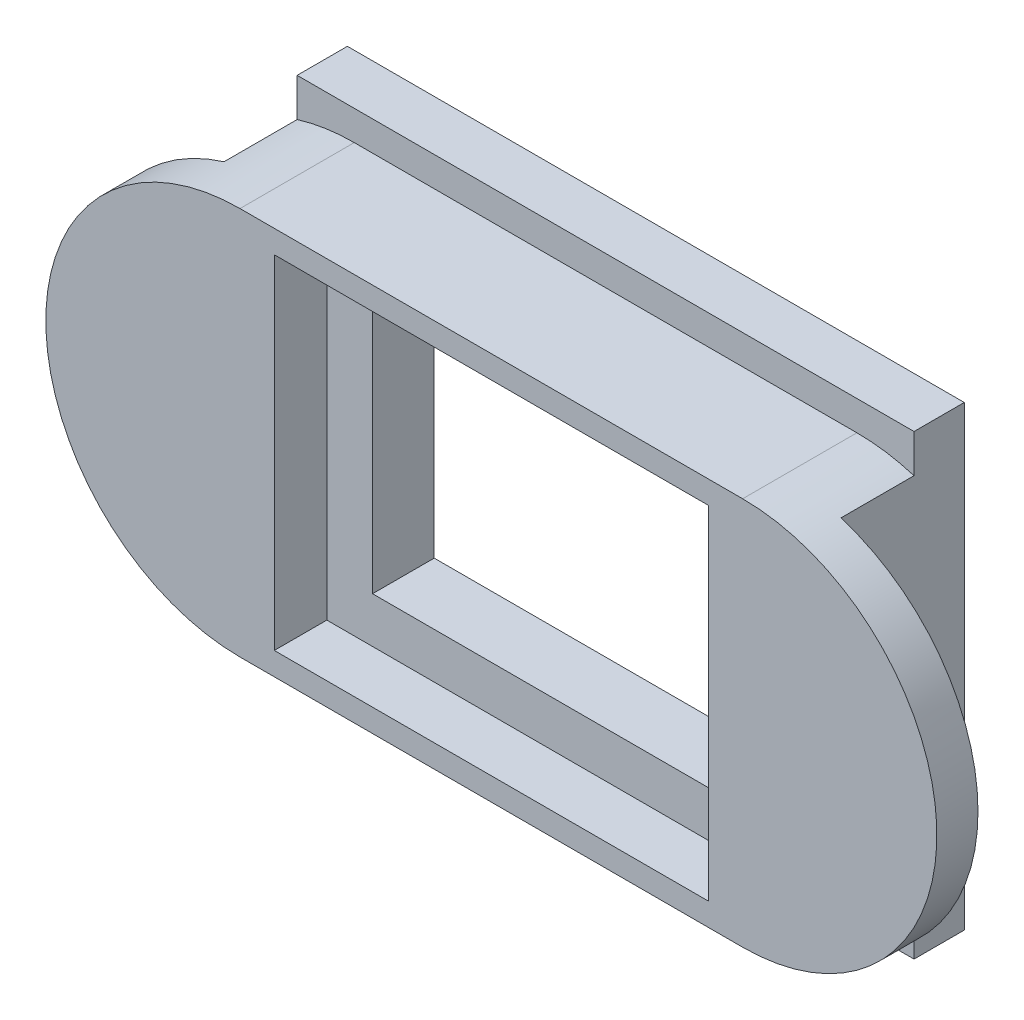
ISO-10303-21;
HEADER;
FILE_DESCRIPTION(('STEP AP214'),'2;1');
FILE_NAME('part.step','',(''),(''),'','','');
FILE_SCHEMA(('AUTOMOTIVE_DESIGN { 1 0 10303 214 1 1 1 1 }'));
ENDSEC;
DATA;
#1=APPLICATION_CONTEXT('core data for automotive mechanical design processes');
#2=APPLICATION_PROTOCOL_DEFINITION('international standard','automotive_design',2000,#1);
#3=PRODUCT_CONTEXT('',#1,'mechanical');
#4=PRODUCT('Part','Part','',(#3));
#5=PRODUCT_RELATED_PRODUCT_CATEGORY('part','',(#4));
#6=PRODUCT_DEFINITION_FORMATION('','',#4);
#7=PRODUCT_DEFINITION_CONTEXT('part definition',#1,'design');
#8=PRODUCT_DEFINITION('design','',#6,#7);
#9=PRODUCT_DEFINITION_SHAPE('','',#8);
#10=(LENGTH_UNIT() NAMED_UNIT(*) SI_UNIT(.MILLI.,.METRE.));
#11=(NAMED_UNIT(*) PLANE_ANGLE_UNIT() SI_UNIT($,.RADIAN.));
#12=(NAMED_UNIT(*) SI_UNIT($,.STERADIAN.) SOLID_ANGLE_UNIT());
#13=UNCERTAINTY_MEASURE_WITH_UNIT(LENGTH_MEASURE(1.E-05),#10,'distance_accuracy_value','');
#14=(GEOMETRIC_REPRESENTATION_CONTEXT(3) GLOBAL_UNCERTAINTY_ASSIGNED_CONTEXT((#13)) GLOBAL_UNIT_ASSIGNED_CONTEXT((#10,
#11,#12)) REPRESENTATION_CONTEXT('',''));
#15=CARTESIAN_POINT('',(0.,0.,0.));
#16=DIRECTION('',(0.,0.,1.));
#17=DIRECTION('',(1.,0.,0.));
#18=AXIS2_PLACEMENT_3D('',#15,#16,#17);
#19=CARTESIAN_POINT('',(-11.,0.,5.));
#20=DIRECTION('',(0.,0.,-1.));
#21=DIRECTION('',(-1.,0.,0.));
#22=AXIS2_PLACEMENT_3D('',#19,#20,#21);
#23=CYLINDRICAL_SURFACE('',#22,8.5);
#24=DIRECTION('',(0.,0.,-1.));
#25=VECTOR('',#24,1.);
#26=CARTESIAN_POINT('',(-13.5,8.12403840463596,5.));
#27=LINE('',#26,#25);
#28=CARTESIAN_POINT('',(-13.5,8.12403840463596,3.2));
#29=VERTEX_POINT('',#28);
#30=CARTESIAN_POINT('',(-13.5,8.12403840463596,0.));
#31=VERTEX_POINT('',#30);
#32=EDGE_CURVE('E13',#29,#31,#27,.T.);
#33=ORIENTED_EDGE('',*,*,#32,.F.);
#34=CARTESIAN_POINT('',(-11.,0.,3.2));
#35=DIRECTION('',(0.,0.,1.));
#36=DIRECTION('',(1.,0.,0.));
#37=AXIS2_PLACEMENT_3D('',#34,#35,#36);
#38=CIRCLE('',#37,8.5);
#39=CARTESIAN_POINT('',(-13.5,-8.12403840463596,3.2));
#40=VERTEX_POINT('',#39);
#41=EDGE_CURVE('E289',#29,#40,#38,.T.);
#42=ORIENTED_EDGE('',*,*,#41,.T.);
#43=DIRECTION('',(0.,0.,-1.));
#44=VECTOR('',#43,1.);
#45=CARTESIAN_POINT('',(-13.5,-8.12403840463596,5.));
#46=LINE('',#45,#44);
#47=CARTESIAN_POINT('',(-13.5,-8.12403840463596,0.));
#48=VERTEX_POINT('',#47);
#49=EDGE_CURVE('E45',#48,#40,#46,.F.);
#50=ORIENTED_EDGE('',*,*,#49,.F.);
#51=CARTESIAN_POINT('',(-11.,0.,0.));
#52=DIRECTION('',(0.,0.,1.));
#53=DIRECTION('',(1.,0.,0.));
#54=AXIS2_PLACEMENT_3D('',#51,#52,#53);
#55=CIRCLE('',#54,8.5);
#56=CARTESIAN_POINT('',(-11.,-8.5,0.));
#57=VERTEX_POINT('',#56);
#58=EDGE_CURVE('E216',#48,#57,#55,.T.);
#59=ORIENTED_EDGE('',*,*,#58,.T.);
#60=DIRECTION('',(0.,0.,-1.));
#61=VECTOR('',#60,1.);
#62=CARTESIAN_POINT('',(-11.,-8.5,5.));
#63=LINE('',#62,#61);
#64=CARTESIAN_POINT('',(-11.,-8.5,5.));
#65=VERTEX_POINT('',#64);
#66=EDGE_CURVE('E268',#65,#57,#63,.T.);
#67=ORIENTED_EDGE('',*,*,#66,.F.);
#68=CARTESIAN_POINT('',(-11.,0.,5.));
#69=DIRECTION('',(0.,0.,1.));
#70=DIRECTION('',(1.,0.,0.));
#71=AXIS2_PLACEMENT_3D('',#68,#69,#70);
#72=CIRCLE('',#71,8.5);
#73=CARTESIAN_POINT('',(-11.,8.5,5.));
#74=VERTEX_POINT('',#73);
#75=EDGE_CURVE('E237',#74,#65,#72,.T.);
#76=ORIENTED_EDGE('',*,*,#75,.F.);
#77=DIRECTION('',(0.,0.,-1.));
#78=VECTOR('',#77,1.);
#79=CARTESIAN_POINT('',(-11.,8.5,5.));
#80=LINE('',#79,#78);
#81=CARTESIAN_POINT('',(-11.,8.5,0.));
#82=VERTEX_POINT('',#81);
#83=EDGE_CURVE('E247',#74,#82,#80,.T.);
#84=ORIENTED_EDGE('',*,*,#83,.T.);
#85=EDGE_CURVE('E248',#82,#31,#55,.T.);
#86=ORIENTED_EDGE('',*,*,#85,.T.);
#87=EDGE_LOOP('',(#33,#42,#50,#59,#67,#76,#84,#86));
#88=FACE_BOUND('',#87,.T.);
#89=ADVANCED_FACE('F38',(#88),#23,.T.);
#90=CARTESIAN_POINT('',(11.,0.,5.));
#91=DIRECTION('',(0.,0.,-1.));
#92=DIRECTION('',(-1.,0.,0.));
#93=AXIS2_PLACEMENT_3D('',#90,#91,#92);
#94=CYLINDRICAL_SURFACE('',#93,8.5);
#95=DIRECTION('',(0.,0.,-1.));
#96=VECTOR('',#95,1.);
#97=CARTESIAN_POINT('',(13.5,-8.12403840463596,5.));
#98=LINE('',#97,#96);
#99=CARTESIAN_POINT('',(13.5,-8.12403840463596,3.2));
#100=VERTEX_POINT('',#99);
#101=CARTESIAN_POINT('',(13.5,-8.12403840463596,0.));
#102=VERTEX_POINT('',#101);
#103=EDGE_CURVE('E276',#100,#102,#98,.T.);
#104=ORIENTED_EDGE('',*,*,#103,.F.);
#105=CARTESIAN_POINT('',(11.,0.,3.2));
#106=DIRECTION('',(0.,0.,1.));
#107=DIRECTION('',(1.,0.,0.));
#108=AXIS2_PLACEMENT_3D('',#105,#106,#107);
#109=CIRCLE('',#108,8.5);
#110=CARTESIAN_POINT('',(13.5,8.12403840463596,3.2));
#111=VERTEX_POINT('',#110);
#112=EDGE_CURVE('E291',#100,#111,#109,.T.);
#113=ORIENTED_EDGE('',*,*,#112,.T.);
#114=DIRECTION('',(0.,0.,-1.));
#115=VECTOR('',#114,1.);
#116=CARTESIAN_POINT('',(13.5,8.12403840463596,5.));
#117=LINE('',#116,#115);
#118=CARTESIAN_POINT('',(13.5,8.12403840463596,0.));
#119=VERTEX_POINT('',#118);
#120=EDGE_CURVE('E273',#119,#111,#117,.F.);
#121=ORIENTED_EDGE('',*,*,#120,.F.);
#122=CARTESIAN_POINT('',(11.,0.,0.));
#123=DIRECTION('',(0.,0.,1.));
#124=DIRECTION('',(1.,0.,0.));
#125=AXIS2_PLACEMENT_3D('',#122,#123,#124);
#126=CIRCLE('',#125,8.5);
#127=CARTESIAN_POINT('',(11.,8.5,0.));
#128=VERTEX_POINT('',#127);
#129=EDGE_CURVE('E254',#119,#128,#126,.T.);
#130=ORIENTED_EDGE('',*,*,#129,.T.);
#131=DIRECTION('',(0.,0.,-1.));
#132=VECTOR('',#131,1.);
#133=CARTESIAN_POINT('',(11.,8.5,5.));
#134=LINE('',#133,#132);
#135=CARTESIAN_POINT('',(11.,8.5,5.));
#136=VERTEX_POINT('',#135);
#137=EDGE_CURVE('E262',#136,#128,#134,.T.);
#138=ORIENTED_EDGE('',*,*,#137,.F.);
#139=CARTESIAN_POINT('',(11.,0.,5.));
#140=DIRECTION('',(0.,0.,1.));
#141=DIRECTION('',(1.,0.,0.));
#142=AXIS2_PLACEMENT_3D('',#139,#140,#141);
#143=CIRCLE('',#142,8.5);
#144=CARTESIAN_POINT('',(11.,-8.49999999999999,5.));
#145=VERTEX_POINT('',#144);
#146=EDGE_CURVE('E243',#145,#136,#143,.T.);
#147=ORIENTED_EDGE('',*,*,#146,.F.);
#148=DIRECTION('',(0.,0.,-1.));
#149=VECTOR('',#148,1.);
#150=CARTESIAN_POINT('',(11.,-8.49999999999999,5.));
#151=LINE('',#150,#149);
#152=CARTESIAN_POINT('',(11.,-8.49999999999999,0.));
#153=VERTEX_POINT('',#152);
#154=EDGE_CURVE('E265',#145,#153,#151,.T.);
#155=ORIENTED_EDGE('',*,*,#154,.T.);
#156=EDGE_CURVE('E255',#153,#102,#126,.T.);
#157=ORIENTED_EDGE('',*,*,#156,.T.);
#158=EDGE_LOOP('',(#104,#113,#121,#130,#138,#147,#155,#157));
#159=FACE_BOUND('',#158,.T.);
#160=ADVANCED_FACE('F393',(#159),#94,.T.);
#161=CARTESIAN_POINT('',(-11.,0.,5.));
#162=DIRECTION('',(0.,0.,1.));
#163=DIRECTION('',(1.,0.,0.));
#164=AXIS2_PLACEMENT_3D('',#161,#162,#163);
#165=PLANE('',#164);
#166=DIRECTION('',(0.,1.,0.));
#167=VECTOR('',#166,1.);
#168=CARTESIAN_POINT('',(9.5,-7.5,5.));
#169=LINE('',#168,#167);
#170=CARTESIAN_POINT('',(9.5,-7.5,5.));
#171=VERTEX_POINT('',#170);
#172=CARTESIAN_POINT('',(9.5,7.5,5.));
#173=VERTEX_POINT('',#172);
#174=EDGE_CURVE('E290',#171,#173,#169,.T.);
#175=ORIENTED_EDGE('',*,*,#174,.F.);
#176=DIRECTION('',(1.,0.,0.));
#177=VECTOR('',#176,1.);
#178=CARTESIAN_POINT('',(-9.5,-7.5,5.));
#179=LINE('',#178,#177);
#180=CARTESIAN_POINT('',(-9.5,-7.5,5.));
#181=VERTEX_POINT('',#180);
#182=EDGE_CURVE('E303',#181,#171,#179,.T.);
#183=ORIENTED_EDGE('',*,*,#182,.F.);
#184=DIRECTION('',(0.,-1.,0.));
#185=VECTOR('',#184,1.);
#186=CARTESIAN_POINT('',(-9.5,-7.5,5.));
#187=LINE('',#186,#185);
#188=CARTESIAN_POINT('',(-9.5,7.5,5.));
#189=VERTEX_POINT('',#188);
#190=EDGE_CURVE('E315',#189,#181,#187,.T.);
#191=ORIENTED_EDGE('',*,*,#190,.F.);
#192=DIRECTION('',(-1.,0.,0.));
#193=VECTOR('',#192,1.);
#194=CARTESIAN_POINT('',(-9.5,7.5,5.));
#195=LINE('',#194,#193);
#196=EDGE_CURVE('E293',#173,#189,#195,.T.);
#197=ORIENTED_EDGE('',*,*,#196,.F.);
#198=EDGE_LOOP('',(#175,#183,#191,#197));
#199=FACE_BOUND('',#198,.T.);
#200=ORIENTED_EDGE('',*,*,#75,.T.);
#201=DIRECTION('',(1.,0.,0.));
#202=VECTOR('',#201,1.);
#203=CARTESIAN_POINT('',(-11.,-8.5,5.));
#204=LINE('',#203,#202);
#205=EDGE_CURVE('E240',#65,#145,#204,.T.);
#206=ORIENTED_EDGE('',*,*,#205,.T.);
#207=ORIENTED_EDGE('',*,*,#146,.T.);
#208=DIRECTION('',(-1.,0.,0.));
#209=VECTOR('',#208,1.);
#210=CARTESIAN_POINT('',(-11.,8.5,5.));
#211=LINE('',#210,#209);
#212=EDGE_CURVE('E245',#136,#74,#211,.T.);
#213=ORIENTED_EDGE('',*,*,#212,.T.);
#214=EDGE_LOOP('',(#200,#206,#207,#213));
#215=FACE_BOUND('',#214,.T.);
#216=ADVANCED_FACE('F424',(#199,#215),#165,.T.);
#217=CARTESIAN_POINT('',(-11.,-8.5,5.));
#218=DIRECTION('',(0.,1.,0.));
#219=DIRECTION('',(-1.,0.,0.));
#220=AXIS2_PLACEMENT_3D('',#217,#218,#219);
#221=PLANE('',#220);
#222=ORIENTED_EDGE('',*,*,#66,.T.);
#223=DIRECTION('',(1.,0.,0.));
#224=VECTOR('',#223,1.);
#225=CARTESIAN_POINT('',(-11.,-8.5,0.));
#226=LINE('',#225,#224);
#227=EDGE_CURVE('E251',#57,#153,#226,.T.);
#228=ORIENTED_EDGE('',*,*,#227,.T.);
#229=ORIENTED_EDGE('',*,*,#154,.F.);
#230=ORIENTED_EDGE('',*,*,#205,.F.);
#231=EDGE_LOOP('',(#222,#228,#229,#230));
#232=FACE_BOUND('',#231,.T.);
#233=ADVANCED_FACE('F427',(#232),#221,.F.);
#234=CARTESIAN_POINT('',(-11.,8.5,5.));
#235=DIRECTION('',(0.,-1.,0.));
#236=DIRECTION('',(1.,0.,0.));
#237=AXIS2_PLACEMENT_3D('',#234,#235,#236);
#238=PLANE('',#237);
#239=ORIENTED_EDGE('',*,*,#137,.T.);
#240=DIRECTION('',(-1.,0.,0.));
#241=VECTOR('',#240,1.);
#242=CARTESIAN_POINT('',(-11.,8.5,0.));
#243=LINE('',#242,#241);
#244=EDGE_CURVE('E241',#128,#82,#243,.T.);
#245=ORIENTED_EDGE('',*,*,#244,.T.);
#246=ORIENTED_EDGE('',*,*,#83,.F.);
#247=ORIENTED_EDGE('',*,*,#212,.F.);
#248=EDGE_LOOP('',(#239,#245,#246,#247));
#249=FACE_BOUND('',#248,.T.);
#250=ADVANCED_FACE('F421',(#249),#238,.F.);
#251=CARTESIAN_POINT('',(7.5,-5.5,5.));
#252=DIRECTION('',(-1.,0.,0.));
#253=DIRECTION('',(0.,0.,1.));
#254=AXIS2_PLACEMENT_3D('',#251,#252,#253);
#255=PLANE('',#254);
#256=DIRECTION('',(0.,-1.,0.));
#257=VECTOR('',#256,1.);
#258=CARTESIAN_POINT('',(7.5,-5.5,2.7));
#259=LINE('',#258,#257);
#260=CARTESIAN_POINT('',(7.5,5.5,2.7));
#261=VERTEX_POINT('',#260);
#262=CARTESIAN_POINT('',(7.5,-5.5,2.7));
#263=VERTEX_POINT('',#262);
#264=EDGE_CURVE('E208',#261,#263,#259,.T.);
#265=ORIENTED_EDGE('',*,*,#264,.F.);
#266=DIRECTION('',(0.,0.,-1.));
#267=VECTOR('',#266,1.);
#268=CARTESIAN_POINT('',(7.5,5.5,5.));
#269=LINE('',#268,#267);
#270=CARTESIAN_POINT('',(7.5,5.5,0.));
#271=VERTEX_POINT('',#270);
#272=EDGE_CURVE('E212',#261,#271,#269,.T.);
#273=ORIENTED_EDGE('',*,*,#272,.T.);
#274=DIRECTION('',(0.,1.,0.));
#275=VECTOR('',#274,1.);
#276=CARTESIAN_POINT('',(7.5,-5.5,0.));
#277=LINE('',#276,#275);
#278=CARTESIAN_POINT('',(7.5,-5.5,0.));
#279=VERTEX_POINT('',#278);
#280=EDGE_CURVE('E200',#279,#271,#277,.T.);
#281=ORIENTED_EDGE('',*,*,#280,.F.);
#282=DIRECTION('',(0.,0.,-1.));
#283=VECTOR('',#282,1.);
#284=CARTESIAN_POINT('',(7.5,-5.5,5.));
#285=LINE('',#284,#283);
#286=EDGE_CURVE('E231',#263,#279,#285,.T.);
#287=ORIENTED_EDGE('',*,*,#286,.F.);
#288=EDGE_LOOP('',(#265,#273,#281,#287));
#289=FACE_BOUND('',#288,.T.);
#290=ADVANCED_FACE('F213',(#289),#255,.T.);
#291=CARTESIAN_POINT('',(-7.5,5.5,5.));
#292=DIRECTION('',(0.,-1.,0.));
#293=DIRECTION('',(0.,0.,-1.));
#294=AXIS2_PLACEMENT_3D('',#291,#292,#293);
#295=PLANE('',#294);
#296=DIRECTION('',(1.,0.,0.));
#297=VECTOR('',#296,1.);
#298=CARTESIAN_POINT('',(-7.5,5.5,2.7));
#299=LINE('',#298,#297);
#300=CARTESIAN_POINT('',(-7.5,5.5,2.7));
#301=VERTEX_POINT('',#300);
#302=EDGE_CURVE('E330',#301,#261,#299,.T.);
#303=ORIENTED_EDGE('',*,*,#302,.F.);
#304=DIRECTION('',(0.,0.,-1.));
#305=VECTOR('',#304,1.);
#306=CARTESIAN_POINT('',(-7.5,5.5,5.));
#307=LINE('',#306,#305);
#308=CARTESIAN_POINT('',(-7.5,5.5,0.));
#309=VERTEX_POINT('',#308);
#310=EDGE_CURVE('E217',#301,#309,#307,.T.);
#311=ORIENTED_EDGE('',*,*,#310,.T.);
#312=DIRECTION('',(-1.,0.,0.));
#313=VECTOR('',#312,1.);
#314=CARTESIAN_POINT('',(-7.5,5.5,0.));
#315=LINE('',#314,#313);
#316=EDGE_CURVE('E190',#271,#309,#315,.T.);
#317=ORIENTED_EDGE('',*,*,#316,.F.);
#318=ORIENTED_EDGE('',*,*,#272,.F.);
#319=EDGE_LOOP('',(#303,#311,#317,#318));
#320=FACE_BOUND('',#319,.T.);
#321=ADVANCED_FACE('F220',(#320),#295,.T.);
#322=CARTESIAN_POINT('',(-7.5,-5.5,5.));
#323=DIRECTION('',(1.,0.,0.));
#324=DIRECTION('',(0.,0.,-1.));
#325=AXIS2_PLACEMENT_3D('',#322,#323,#324);
#326=PLANE('',#325);
#327=DIRECTION('',(0.,1.,0.));
#328=VECTOR('',#327,1.);
#329=CARTESIAN_POINT('',(-7.5,-5.5,2.7));
#330=LINE('',#329,#328);
#331=CARTESIAN_POINT('',(-7.5,-5.5,2.7));
#332=VERTEX_POINT('',#331);
#333=EDGE_CURVE('E322',#332,#301,#330,.T.);
#334=ORIENTED_EDGE('',*,*,#333,.F.);
#335=DIRECTION('',(0.,0.,-1.));
#336=VECTOR('',#335,1.);
#337=CARTESIAN_POINT('',(-7.5,-5.5,5.));
#338=LINE('',#337,#336);
#339=CARTESIAN_POINT('',(-7.5,-5.5,0.));
#340=VERTEX_POINT('',#339);
#341=EDGE_CURVE('E233',#332,#340,#338,.T.);
#342=ORIENTED_EDGE('',*,*,#341,.T.);
#343=DIRECTION('',(0.,-1.,0.));
#344=VECTOR('',#343,1.);
#345=CARTESIAN_POINT('',(-7.5,-5.5,0.));
#346=LINE('',#345,#344);
#347=EDGE_CURVE('E223',#309,#340,#346,.T.);
#348=ORIENTED_EDGE('',*,*,#347,.F.);
#349=ORIENTED_EDGE('',*,*,#310,.F.);
#350=EDGE_LOOP('',(#334,#342,#348,#349));
#351=FACE_BOUND('',#350,.T.);
#352=ADVANCED_FACE('F341',(#351),#326,.T.);
#353=CARTESIAN_POINT('',(-7.5,-5.5,5.));
#354=DIRECTION('',(0.,1.,0.));
#355=DIRECTION('',(0.,0.,1.));
#356=AXIS2_PLACEMENT_3D('',#353,#354,#355);
#357=PLANE('',#356);
#358=DIRECTION('',(-1.,0.,0.));
#359=VECTOR('',#358,1.);
#360=CARTESIAN_POINT('',(-7.5,-5.5,2.7));
#361=LINE('',#360,#359);
#362=EDGE_CURVE('E271',#263,#332,#361,.T.);
#363=ORIENTED_EDGE('',*,*,#362,.F.);
#364=ORIENTED_EDGE('',*,*,#286,.T.);
#365=DIRECTION('',(1.,0.,0.));
#366=VECTOR('',#365,1.);
#367=CARTESIAN_POINT('',(-7.5,-5.5,0.));
#368=LINE('',#367,#366);
#369=EDGE_CURVE('E226',#340,#279,#368,.T.);
#370=ORIENTED_EDGE('',*,*,#369,.F.);
#371=ORIENTED_EDGE('',*,*,#341,.F.);
#372=EDGE_LOOP('',(#363,#364,#370,#371));
#373=FACE_BOUND('',#372,.T.);
#374=ADVANCED_FACE('F338',(#373),#357,.T.);
#375=CARTESIAN_POINT('',(9.5,-7.5,2.7));
#376=DIRECTION('',(1.,0.,0.));
#377=DIRECTION('',(0.,0.,-1.));
#378=AXIS2_PLACEMENT_3D('',#375,#376,#377);
#379=PLANE('',#378);
#380=ORIENTED_EDGE('',*,*,#174,.T.);
#381=DIRECTION('',(0.,0.,1.));
#382=VECTOR('',#381,1.);
#383=CARTESIAN_POINT('',(9.5,7.5,2.7));
#384=LINE('',#383,#382);
#385=CARTESIAN_POINT('',(9.5,7.5,2.7));
#386=VERTEX_POINT('',#385);
#387=EDGE_CURVE('E311',#386,#173,#384,.T.);
#388=ORIENTED_EDGE('',*,*,#387,.F.);
#389=DIRECTION('',(0.,1.,0.));
#390=VECTOR('',#389,1.);
#391=CARTESIAN_POINT('',(9.5,-7.5,2.7));
#392=LINE('',#391,#390);
#393=CARTESIAN_POINT('',(9.5,-7.5,2.7));
#394=VERTEX_POINT('',#393);
#395=EDGE_CURVE('E299',#394,#386,#392,.T.);
#396=ORIENTED_EDGE('',*,*,#395,.F.);
#397=DIRECTION('',(0.,0.,1.));
#398=VECTOR('',#397,1.);
#399=CARTESIAN_POINT('',(9.5,-7.5,2.7));
#400=LINE('',#399,#398);
#401=EDGE_CURVE('E320',#394,#171,#400,.T.);
#402=ORIENTED_EDGE('',*,*,#401,.T.);
#403=EDGE_LOOP('',(#380,#388,#396,#402));
#404=FACE_BOUND('',#403,.T.);
#405=ADVANCED_FACE('F452',(#404),#379,.F.);
#406=CARTESIAN_POINT('',(-9.5,-7.5,2.7));
#407=DIRECTION('',(0.,-1.,0.));
#408=DIRECTION('',(0.,0.,-1.));
#409=AXIS2_PLACEMENT_3D('',#406,#407,#408);
#410=PLANE('',#409);
#411=ORIENTED_EDGE('',*,*,#182,.T.);
#412=ORIENTED_EDGE('',*,*,#401,.F.);
#413=DIRECTION('',(1.,0.,0.));
#414=VECTOR('',#413,1.);
#415=CARTESIAN_POINT('',(-9.5,-7.5,2.7));
#416=LINE('',#415,#414);
#417=CARTESIAN_POINT('',(-9.5,-7.5,2.7));
#418=VERTEX_POINT('',#417);
#419=EDGE_CURVE('E309',#418,#394,#416,.T.);
#420=ORIENTED_EDGE('',*,*,#419,.F.);
#421=DIRECTION('',(0.,0.,1.));
#422=VECTOR('',#421,1.);
#423=CARTESIAN_POINT('',(-9.5,-7.5,2.7));
#424=LINE('',#423,#422);
#425=EDGE_CURVE('E323',#418,#181,#424,.T.);
#426=ORIENTED_EDGE('',*,*,#425,.T.);
#427=EDGE_LOOP('',(#411,#412,#420,#426));
#428=FACE_BOUND('',#427,.T.);
#429=ADVANCED_FACE('F455',(#428),#410,.F.);
#430=CARTESIAN_POINT('',(-9.5,-7.5,2.7));
#431=DIRECTION('',(-1.,0.,0.));
#432=DIRECTION('',(0.,0.,1.));
#433=AXIS2_PLACEMENT_3D('',#430,#431,#432);
#434=PLANE('',#433);
#435=ORIENTED_EDGE('',*,*,#190,.T.);
#436=ORIENTED_EDGE('',*,*,#425,.F.);
#437=DIRECTION('',(0.,-1.,0.));
#438=VECTOR('',#437,1.);
#439=CARTESIAN_POINT('',(-9.5,-7.5,2.7));
#440=LINE('',#439,#438);
#441=CARTESIAN_POINT('',(-9.5,7.5,2.7));
#442=VERTEX_POINT('',#441);
#443=EDGE_CURVE('E306',#442,#418,#440,.T.);
#444=ORIENTED_EDGE('',*,*,#443,.F.);
#445=DIRECTION('',(0.,0.,1.));
#446=VECTOR('',#445,1.);
#447=CARTESIAN_POINT('',(-9.5,7.5,2.7));
#448=LINE('',#447,#446);
#449=EDGE_CURVE('E325',#442,#189,#448,.T.);
#450=ORIENTED_EDGE('',*,*,#449,.T.);
#451=EDGE_LOOP('',(#435,#436,#444,#450));
#452=FACE_BOUND('',#451,.T.);
#453=ADVANCED_FACE('F460',(#452),#434,.F.);
#454=CARTESIAN_POINT('',(-9.5,7.5,2.7));
#455=DIRECTION('',(0.,1.,0.));
#456=DIRECTION('',(0.,0.,1.));
#457=AXIS2_PLACEMENT_3D('',#454,#455,#456);
#458=PLANE('',#457);
#459=ORIENTED_EDGE('',*,*,#196,.T.);
#460=ORIENTED_EDGE('',*,*,#449,.F.);
#461=DIRECTION('',(-1.,0.,0.));
#462=VECTOR('',#461,1.);
#463=CARTESIAN_POINT('',(-9.5,7.5,2.7));
#464=LINE('',#463,#462);
#465=EDGE_CURVE('E302',#386,#442,#464,.T.);
#466=ORIENTED_EDGE('',*,*,#465,.F.);
#467=ORIENTED_EDGE('',*,*,#387,.T.);
#468=EDGE_LOOP('',(#459,#460,#466,#467));
#469=FACE_BOUND('',#468,.T.);
#470=ADVANCED_FACE('F457',(#469),#458,.F.);
#471=CARTESIAN_POINT('',(0.,0.,2.7));
#472=DIRECTION('',(0.,0.,-1.));
#473=DIRECTION('',(-1.,0.,0.));
#474=AXIS2_PLACEMENT_3D('',#471,#472,#473);
#475=PLANE('',#474);
#476=ORIENTED_EDGE('',*,*,#264,.T.);
#477=ORIENTED_EDGE('',*,*,#362,.T.);
#478=ORIENTED_EDGE('',*,*,#333,.T.);
#479=ORIENTED_EDGE('',*,*,#302,.T.);
#480=EDGE_LOOP('',(#476,#477,#478,#479));
#481=FACE_BOUND('',#480,.T.);
#482=ORIENTED_EDGE('',*,*,#395,.T.);
#483=ORIENTED_EDGE('',*,*,#465,.T.);
#484=ORIENTED_EDGE('',*,*,#443,.T.);
#485=ORIENTED_EDGE('',*,*,#419,.T.);
#486=EDGE_LOOP('',(#482,#483,#484,#485));
#487=FACE_BOUND('',#486,.T.);
#488=ADVANCED_FACE('F333',(#481,#487),#475,.F.);
#489=CARTESIAN_POINT('',(-11.,0.,3.2));
#490=DIRECTION('',(0.,0.,1.));
#491=DIRECTION('',(1.,0.,0.));
#492=AXIS2_PLACEMENT_3D('',#489,#490,#491);
#493=PLANE('',#492);
#494=DIRECTION('',(0.,-1.,0.));
#495=VECTOR('',#494,1.);
#496=CARTESIAN_POINT('',(13.5,8.5,3.2));
#497=LINE('',#496,#495);
#498=EDGE_CURVE('E385',#111,#100,#497,.T.);
#499=ORIENTED_EDGE('',*,*,#498,.F.);
#500=ORIENTED_EDGE('',*,*,#112,.F.);
#501=EDGE_LOOP('',(#499,#500));
#502=FACE_BOUND('',#501,.T.);
#503=ADVANCED_FACE('F470',(#502),#493,.F.);
#504=CARTESIAN_POINT('',(13.5,8.5,48.2016872565222));
#505=DIRECTION('',(1.,0.,0.));
#506=DIRECTION('',(0.,0.,-1.));
#507=AXIS2_PLACEMENT_3D('',#504,#505,#506);
#508=PLANE('',#507);
#509=ORIENTED_EDGE('',*,*,#103,.T.);
#510=DIRECTION('',(0.,-1.,0.));
#511=VECTOR('',#510,1.);
#512=CARTESIAN_POINT('',(13.5,9.8,0.));
#513=LINE('',#512,#511);
#514=CARTESIAN_POINT('',(13.5,-10.2,0.));
#515=VERTEX_POINT('',#514);
#516=EDGE_CURVE('E370',#102,#515,#513,.T.);
#517=ORIENTED_EDGE('',*,*,#516,.T.);
#518=DIRECTION('',(0.,0.,1.));
#519=VECTOR('',#518,1.);
#520=CARTESIAN_POINT('',(13.5,-10.2,-2.2));
#521=LINE('',#520,#519);
#522=CARTESIAN_POINT('',(13.5,-10.2,-2.2));
#523=VERTEX_POINT('',#522);
#524=EDGE_CURVE('E382',#523,#515,#521,.T.);
#525=ORIENTED_EDGE('',*,*,#524,.F.);
#526=DIRECTION('',(0.,-1.,0.));
#527=VECTOR('',#526,1.);
#528=CARTESIAN_POINT('',(13.5,9.8,-2.2));
#529=LINE('',#528,#527);
#530=CARTESIAN_POINT('',(13.5,9.8,-2.2));
#531=VERTEX_POINT('',#530);
#532=EDGE_CURVE('E355',#531,#523,#529,.T.);
#533=ORIENTED_EDGE('',*,*,#532,.F.);
#534=DIRECTION('',(0.,0.,1.));
#535=VECTOR('',#534,1.);
#536=CARTESIAN_POINT('',(13.5,9.8,-2.2));
#537=LINE('',#536,#535);
#538=CARTESIAN_POINT('',(13.5,9.8,0.));
#539=VERTEX_POINT('',#538);
#540=EDGE_CURVE('E365',#531,#539,#537,.T.);
#541=ORIENTED_EDGE('',*,*,#540,.T.);
#542=EDGE_CURVE('E366',#539,#119,#513,.T.);
#543=ORIENTED_EDGE('',*,*,#542,.T.);
#544=ORIENTED_EDGE('',*,*,#120,.T.);
#545=ORIENTED_EDGE('',*,*,#498,.T.);
#546=EDGE_LOOP('',(#509,#517,#525,#533,#541,#543,#544,#545));
#547=FACE_BOUND('',#546,.T.);
#548=ADVANCED_FACE('F389',(#547),#508,.T.);
#549=CARTESIAN_POINT('',(-13.5,8.5,48.2016872565222));
#550=DIRECTION('',(-1.,0.,0.));
#551=DIRECTION('',(0.,0.,1.));
#552=AXIS2_PLACEMENT_3D('',#549,#550,#551);
#553=PLANE('',#552);
#554=ORIENTED_EDGE('',*,*,#32,.T.);
#555=DIRECTION('',(0.,1.,0.));
#556=VECTOR('',#555,1.);
#557=CARTESIAN_POINT('',(-13.5,9.8,0.));
#558=LINE('',#557,#556);
#559=CARTESIAN_POINT('',(-13.5,9.8,0.));
#560=VERTEX_POINT('',#559);
#561=EDGE_CURVE('E372',#31,#560,#558,.T.);
#562=ORIENTED_EDGE('',*,*,#561,.T.);
#563=DIRECTION('',(0.,0.,1.));
#564=VECTOR('',#563,1.);
#565=CARTESIAN_POINT('',(-13.5,9.8,-2.2));
#566=LINE('',#565,#564);
#567=CARTESIAN_POINT('',(-13.5,9.8,-2.2));
#568=VERTEX_POINT('',#567);
#569=EDGE_CURVE('E377',#568,#560,#566,.T.);
#570=ORIENTED_EDGE('',*,*,#569,.F.);
#571=DIRECTION('',(0.,1.,0.));
#572=VECTOR('',#571,1.);
#573=CARTESIAN_POINT('',(-13.5,9.8,-2.2));
#574=LINE('',#573,#572);
#575=CARTESIAN_POINT('',(-13.5,-10.2,-2.2));
#576=VERTEX_POINT('',#575);
#577=EDGE_CURVE('E361',#576,#568,#574,.T.);
#578=ORIENTED_EDGE('',*,*,#577,.F.);
#579=DIRECTION('',(0.,0.,1.));
#580=VECTOR('',#579,1.);
#581=CARTESIAN_POINT('',(-13.5,-10.2,-2.2));
#582=LINE('',#581,#580);
#583=CARTESIAN_POINT('',(-13.5,-10.2,0.));
#584=VERTEX_POINT('',#583);
#585=EDGE_CURVE('E380',#576,#584,#582,.T.);
#586=ORIENTED_EDGE('',*,*,#585,.T.);
#587=EDGE_CURVE('E286',#584,#48,#558,.T.);
#588=ORIENTED_EDGE('',*,*,#587,.T.);
#589=ORIENTED_EDGE('',*,*,#49,.T.);
#590=DIRECTION('',(0.,1.,0.));
#591=VECTOR('',#590,1.);
#592=CARTESIAN_POINT('',(-13.5,8.5,3.2));
#593=LINE('',#592,#591);
#594=EDGE_CURVE('E59',#40,#29,#593,.T.);
#595=ORIENTED_EDGE('',*,*,#594,.T.);
#596=EDGE_LOOP('',(#554,#562,#570,#578,#586,#588,#589,#595));
#597=FACE_BOUND('',#596,.T.);
#598=ADVANCED_FACE('F282',(#597),#553,.T.);
#599=ORIENTED_EDGE('',*,*,#594,.F.);
#600=ORIENTED_EDGE('',*,*,#41,.F.);
#601=EDGE_LOOP('',(#599,#600));
#602=FACE_BOUND('',#601,.T.);
#603=ADVANCED_FACE('F471',(#602),#493,.F.);
#604=CARTESIAN_POINT('',(0.,0.,0.));
#605=DIRECTION('',(0.,0.,-1.));
#606=DIRECTION('',(-1.,0.,0.));
#607=AXIS2_PLACEMENT_3D('',#604,#605,#606);
#608=PLANE('',#607);
#609=ORIENTED_EDGE('',*,*,#85,.F.);
#610=ORIENTED_EDGE('',*,*,#244,.F.);
#611=ORIENTED_EDGE('',*,*,#129,.F.);
#612=ORIENTED_EDGE('',*,*,#542,.F.);
#613=DIRECTION('',(1.,0.,0.));
#614=VECTOR('',#613,1.);
#615=CARTESIAN_POINT('',(13.5,9.8,0.));
#616=LINE('',#615,#614);
#617=EDGE_CURVE('E359',#560,#539,#616,.T.);
#618=ORIENTED_EDGE('',*,*,#617,.F.);
#619=ORIENTED_EDGE('',*,*,#561,.F.);
#620=EDGE_LOOP('',(#609,#610,#611,#612,#618,#619));
#621=FACE_BOUND('',#620,.T.);
#622=ADVANCED_FACE('F415',(#621),#608,.F.);
#623=CARTESIAN_POINT('',(0.,0.,-2.2));
#624=DIRECTION('',(0.,0.,-1.));
#625=DIRECTION('',(-1.,0.,0.));
#626=AXIS2_PLACEMENT_3D('',#623,#624,#625);
#627=PLANE('',#626);
#628=DIRECTION('',(0.,1.,0.));
#629=VECTOR('',#628,1.);
#630=CARTESIAN_POINT('',(10.8877029203921,0.,-2.2));
#631=LINE('',#630,#629);
#632=CARTESIAN_POINT('',(10.8877029203921,-8.88770292039209,-2.2));
#633=VERTEX_POINT('',#632);
#634=CARTESIAN_POINT('',(10.8877029203921,8.88770292039209,-2.2));
#635=VERTEX_POINT('',#634);
#636=EDGE_CURVE('E349',#633,#635,#631,.T.);
#637=ORIENTED_EDGE('',*,*,#636,.T.);
#638=DIRECTION('',(-1.,0.,0.));
#639=VECTOR('',#638,1.);
#640=CARTESIAN_POINT('',(0.,8.88770292039209,-2.2));
#641=LINE('',#640,#639);
#642=CARTESIAN_POINT('',(-10.8877029203921,8.88770292039209,-2.2));
#643=VERTEX_POINT('',#642);
#644=EDGE_CURVE('E192',#635,#643,#641,.T.);
#645=ORIENTED_EDGE('',*,*,#644,.T.);
#646=DIRECTION('',(0.,-1.,0.));
#647=VECTOR('',#646,1.);
#648=CARTESIAN_POINT('',(-10.8877029203921,0.,-2.2));
#649=LINE('',#648,#647);
#650=CARTESIAN_POINT('',(-10.8877029203921,-8.88770292039209,-2.2));
#651=VERTEX_POINT('',#650);
#652=EDGE_CURVE('E52',#643,#651,#649,.T.);
#653=ORIENTED_EDGE('',*,*,#652,.T.);
#654=DIRECTION('',(1.,0.,0.));
#655=VECTOR('',#654,1.);
#656=CARTESIAN_POINT('',(0.,-8.88770292039209,-2.2));
#657=LINE('',#656,#655);
#658=EDGE_CURVE('E197',#651,#633,#657,.T.);
#659=ORIENTED_EDGE('',*,*,#658,.T.);
#660=EDGE_LOOP('',(#637,#645,#653,#659));
#661=FACE_BOUND('',#660,.T.);
#662=ORIENTED_EDGE('',*,*,#532,.T.);
#663=DIRECTION('',(-1.,0.,0.));
#664=VECTOR('',#663,1.);
#665=CARTESIAN_POINT('',(13.5,-10.2,-2.2));
#666=LINE('',#665,#664);
#667=EDGE_CURVE('E358',#523,#576,#666,.T.);
#668=ORIENTED_EDGE('',*,*,#667,.T.);
#669=ORIENTED_EDGE('',*,*,#577,.T.);
#670=DIRECTION('',(1.,0.,0.));
#671=VECTOR('',#670,1.);
#672=CARTESIAN_POINT('',(13.5,9.8,-2.2));
#673=LINE('',#672,#671);
#674=EDGE_CURVE('E363',#568,#531,#673,.T.);
#675=ORIENTED_EDGE('',*,*,#674,.T.);
#676=EDGE_LOOP('',(#662,#668,#669,#675));
#677=FACE_BOUND('',#676,.T.);
#678=ADVANCED_FACE('F406',(#661,#677),#627,.T.);
#679=CARTESIAN_POINT('',(13.5,9.8,-2.2));
#680=DIRECTION('',(0.,-1.,0.));
#681=DIRECTION('',(0.,0.,-1.));
#682=AXIS2_PLACEMENT_3D('',#679,#680,#681);
#683=PLANE('',#682);
#684=ORIENTED_EDGE('',*,*,#617,.T.);
#685=ORIENTED_EDGE('',*,*,#540,.F.);
#686=ORIENTED_EDGE('',*,*,#674,.F.);
#687=ORIENTED_EDGE('',*,*,#569,.T.);
#688=EDGE_LOOP('',(#684,#685,#686,#687));
#689=FACE_BOUND('',#688,.T.);
#690=ADVANCED_FACE('F411',(#689),#683,.F.);
#691=CARTESIAN_POINT('',(13.5,-10.2,-2.2));
#692=DIRECTION('',(0.,1.,0.));
#693=DIRECTION('',(0.,0.,1.));
#694=AXIS2_PLACEMENT_3D('',#691,#692,#693);
#695=PLANE('',#694);
#696=DIRECTION('',(-1.,0.,0.));
#697=VECTOR('',#696,1.);
#698=CARTESIAN_POINT('',(13.5,-10.2,0.));
#699=LINE('',#698,#697);
#700=EDGE_CURVE('E369',#515,#584,#699,.T.);
#701=ORIENTED_EDGE('',*,*,#700,.T.);
#702=ORIENTED_EDGE('',*,*,#585,.F.);
#703=ORIENTED_EDGE('',*,*,#667,.F.);
#704=ORIENTED_EDGE('',*,*,#524,.T.);
#705=EDGE_LOOP('',(#701,#702,#703,#704));
#706=FACE_BOUND('',#705,.T.);
#707=ADVANCED_FACE('F402',(#706),#695,.F.);
#708=ORIENTED_EDGE('',*,*,#156,.F.);
#709=ORIENTED_EDGE('',*,*,#227,.F.);
#710=ORIENTED_EDGE('',*,*,#58,.F.);
#711=ORIENTED_EDGE('',*,*,#587,.F.);
#712=ORIENTED_EDGE('',*,*,#700,.F.);
#713=ORIENTED_EDGE('',*,*,#516,.F.);
#714=EDGE_LOOP('',(#708,#709,#710,#711,#712,#713));
#715=FACE_BOUND('',#714,.T.);
#716=ADVANCED_FACE('F397',(#715),#608,.F.);
#717=CARTESIAN_POINT('',(7.5,-5.5,0.));
#718=DIRECTION('',(0.544639035015026,0.,0.838670567945425));
#719=DIRECTION('',(0.838670567945425,0.,-0.544639035015026));
#720=AXIS2_PLACEMENT_3D('',#717,#718,#719);
#721=PLANE('',#720);
#722=ORIENTED_EDGE('',*,*,#280,.T.);
#723=DIRECTION('',(-0.642594670326267,-0.642594670326267,0.417305858258128));
#724=VECTOR('',#723,1.);
#725=CARTESIAN_POINT('',(2.95779298635104,0.95779298635104,2.94974372453862));
#726=LINE('',#725,#724);
#727=EDGE_CURVE('E186',#635,#271,#726,.T.);
#728=ORIENTED_EDGE('',*,*,#727,.F.);
#729=ORIENTED_EDGE('',*,*,#636,.F.);
#730=DIRECTION('',(-0.642594670326267,0.642594670326267,0.417305858258128));
#731=VECTOR('',#730,1.);
#732=CARTESIAN_POINT('',(1.30608134502415,0.693918654975853,4.02237780618902));
#733=LINE('',#732,#731);
#734=EDGE_CURVE('E203',#633,#279,#733,.T.);
#735=ORIENTED_EDGE('',*,*,#734,.T.);
#736=EDGE_LOOP('',(#722,#728,#729,#735));
#737=FACE_BOUND('',#736,.T.);
#738=ADVANCED_FACE('F202',(#737),#721,.F.);
#739=CARTESIAN_POINT('',(-7.5,-5.5,0.));
#740=DIRECTION('',(0.,-0.544639035015026,0.838670567945425));
#741=DIRECTION('',(0.,-0.838670567945425,-0.544639035015026));
#742=AXIS2_PLACEMENT_3D('',#739,#740,#741);
#743=PLANE('',#742);
#744=ORIENTED_EDGE('',*,*,#369,.T.);
#745=ORIENTED_EDGE('',*,*,#734,.F.);
#746=ORIENTED_EDGE('',*,*,#658,.F.);
#747=DIRECTION('',(0.642594670326267,0.642594670326267,0.417305858258128));
#748=VECTOR('',#747,1.);
#749=CARTESIAN_POINT('',(-2.95779298635104,-0.957792986351038,2.94974372453862));
#750=LINE('',#749,#748);
#751=EDGE_CURVE('E343',#651,#340,#750,.T.);
#752=ORIENTED_EDGE('',*,*,#751,.T.);
#753=EDGE_LOOP('',(#744,#745,#746,#752));
#754=FACE_BOUND('',#753,.T.);
#755=ADVANCED_FACE('F487',(#754),#743,.F.);
#756=CARTESIAN_POINT('',(-7.5,5.5,0.));
#757=DIRECTION('',(-0.544639035015026,0.,0.838670567945425));
#758=DIRECTION('',(0.838670567945425,0.,0.544639035015026));
#759=AXIS2_PLACEMENT_3D('',#756,#757,#758);
#760=PLANE('',#759);
#761=ORIENTED_EDGE('',*,*,#347,.T.);
#762=ORIENTED_EDGE('',*,*,#751,.F.);
#763=ORIENTED_EDGE('',*,*,#652,.F.);
#764=DIRECTION('',(0.642594670326267,-0.642594670326267,0.417305858258128));
#765=VECTOR('',#764,1.);
#766=CARTESIAN_POINT('',(-1.30608134502414,-0.693918654975855,4.02237780618902));
#767=LINE('',#766,#765);
#768=EDGE_CURVE('E196',#643,#309,#767,.T.);
#769=ORIENTED_EDGE('',*,*,#768,.T.);
#770=EDGE_LOOP('',(#761,#762,#763,#769));
#771=FACE_BOUND('',#770,.T.);
#772=ADVANCED_FACE('F342',(#771),#760,.F.);
#773=CARTESIAN_POINT('',(7.5,5.5,0.));
#774=DIRECTION('',(0.,0.544639035015026,0.838670567945425));
#775=DIRECTION('',(0.,-0.838670567945425,0.544639035015026));
#776=AXIS2_PLACEMENT_3D('',#773,#774,#775);
#777=PLANE('',#776);
#778=ORIENTED_EDGE('',*,*,#316,.T.);
#779=ORIENTED_EDGE('',*,*,#768,.F.);
#780=ORIENTED_EDGE('',*,*,#644,.F.);
#781=ORIENTED_EDGE('',*,*,#727,.T.);
#782=EDGE_LOOP('',(#778,#779,#780,#781));
#783=FACE_BOUND('',#782,.T.);
#784=ADVANCED_FACE('F188',(#783),#777,.F.);
#785=CLOSED_SHELL('',(#89,#160,#216,#233,#250,#290,#321,#352,#374,#405,#429,#453,#470,#488,#503,
#548,#598,#603,#622,#678,#690,#707,#716,#738,#755,#772,#784));
#786=MANIFOLD_SOLID_BREP('B2',#785);
#787=ADVANCED_BREP_SHAPE_REPRESENTATION('',(#18,#786),#14);
#788=SHAPE_DEFINITION_REPRESENTATION(#9,#787);
ENDSEC;
END-ISO-10303-21;
